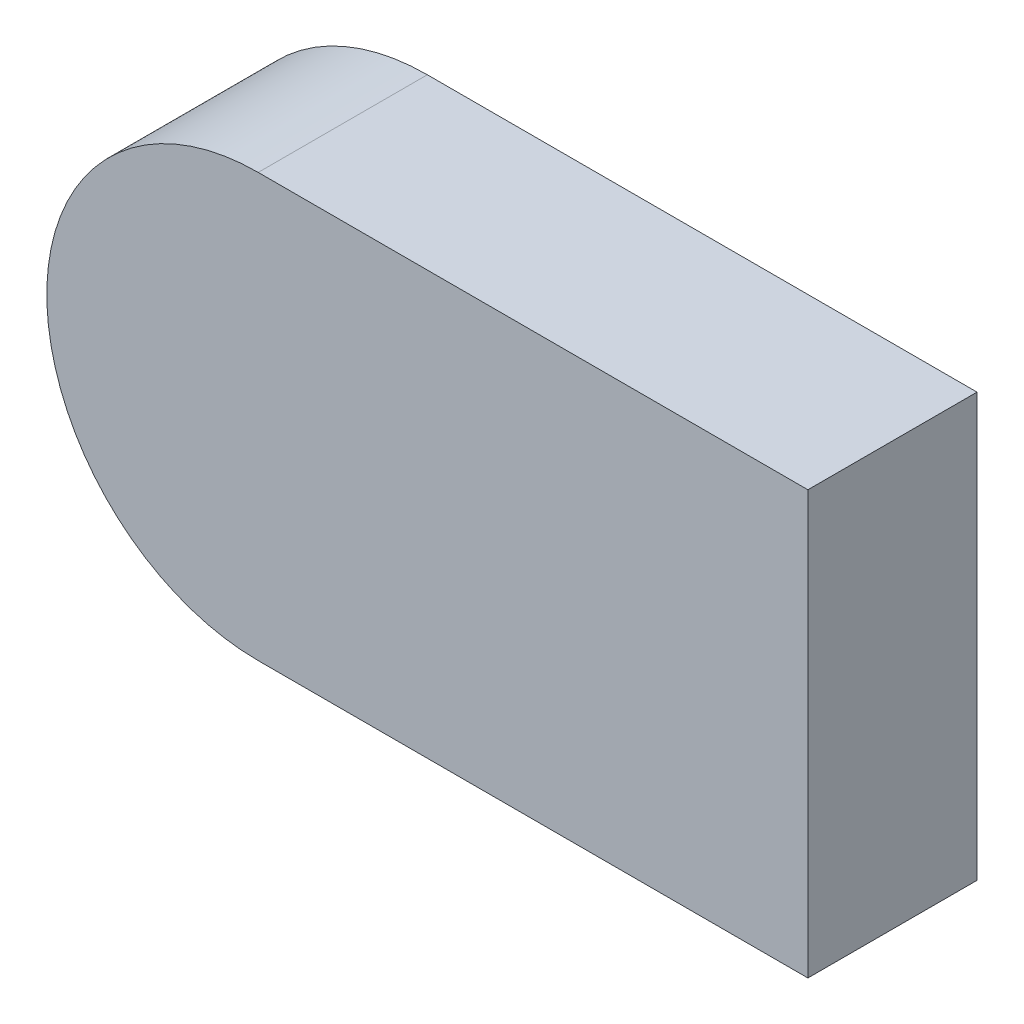
ISO-10303-21;
HEADER;
FILE_DESCRIPTION(('STEP AP214'),'2;1');
FILE_NAME('part.step','',(''),(''),'','','');
FILE_SCHEMA(('AUTOMOTIVE_DESIGN { 1 0 10303 214 1 1 1 1 }'));
ENDSEC;
DATA;
#1=APPLICATION_CONTEXT('core data for automotive mechanical design processes');
#2=APPLICATION_PROTOCOL_DEFINITION('international standard','automotive_design',2000,#1);
#3=PRODUCT_CONTEXT('',#1,'mechanical');
#4=PRODUCT('Part','Part','',(#3));
#5=PRODUCT_RELATED_PRODUCT_CATEGORY('part','',(#4));
#6=PRODUCT_DEFINITION_FORMATION('','',#4);
#7=PRODUCT_DEFINITION_CONTEXT('part definition',#1,'design');
#8=PRODUCT_DEFINITION('design','',#6,#7);
#9=PRODUCT_DEFINITION_SHAPE('','',#8);
#10=(LENGTH_UNIT() NAMED_UNIT(*) SI_UNIT(.MILLI.,.METRE.));
#11=(NAMED_UNIT(*) PLANE_ANGLE_UNIT() SI_UNIT($,.RADIAN.));
#12=(NAMED_UNIT(*) SI_UNIT($,.STERADIAN.) SOLID_ANGLE_UNIT());
#13=UNCERTAINTY_MEASURE_WITH_UNIT(LENGTH_MEASURE(1.E-05),#10,'distance_accuracy_value','');
#14=(GEOMETRIC_REPRESENTATION_CONTEXT(3) GLOBAL_UNCERTAINTY_ASSIGNED_CONTEXT((#13)) GLOBAL_UNIT_ASSIGNED_CONTEXT((#10,
#11,#12)) REPRESENTATION_CONTEXT('',''));
#15=CARTESIAN_POINT('',(0.,0.,0.));
#16=DIRECTION('',(0.,0.,1.));
#17=DIRECTION('',(1.,0.,0.));
#18=AXIS2_PLACEMENT_3D('',#15,#16,#17);
#19=CARTESIAN_POINT('',(2.05,-0.875,0.));
#20=DIRECTION('',(0.,-1.,0.));
#21=DIRECTION('',(-1.,0.,0.));
#22=AXIS2_PLACEMENT_3D('',#19,#20,#21);
#23=PLANE('',#22);
#24=DIRECTION('',(0.,0.,1.));
#25=VECTOR('',#24,1.);
#26=CARTESIAN_POINT('',(2.05,-0.875,0.));
#27=LINE('',#26,#25);
#28=CARTESIAN_POINT('',(2.05,-0.875,0.));
#29=VERTEX_POINT('',#28);
#30=CARTESIAN_POINT('',(2.05,-0.875,0.1));
#31=VERTEX_POINT('',#30);
#32=EDGE_CURVE('E11',#29,#31,#27,.T.);
#33=ORIENTED_EDGE('',*,*,#32,.T.);
#34=DIRECTION('',(-1.,0.,0.));
#35=VECTOR('',#34,1.);
#36=CARTESIAN_POINT('',(2.05,-0.875,0.1));
#37=LINE('',#36,#35);
#38=CARTESIAN_POINT('',(1.725,-0.875,0.1));
#39=VERTEX_POINT('',#38);
#40=EDGE_CURVE('E24',#31,#39,#37,.T.);
#41=ORIENTED_EDGE('',*,*,#40,.T.);
#42=DIRECTION('',(0.,0.,1.));
#43=VECTOR('',#42,1.);
#44=CARTESIAN_POINT('',(1.725,-0.875,0.));
#45=LINE('',#44,#43);
#46=CARTESIAN_POINT('',(1.725,-0.875,0.));
#47=VERTEX_POINT('',#46);
#48=EDGE_CURVE('E86',#47,#39,#45,.T.);
#49=ORIENTED_EDGE('',*,*,#48,.F.);
#50=DIRECTION('',(-1.,0.,0.));
#51=VECTOR('',#50,1.);
#52=CARTESIAN_POINT('',(2.05,-0.875,0.));
#53=LINE('',#52,#51);
#54=EDGE_CURVE('E83',#29,#47,#53,.T.);
#55=ORIENTED_EDGE('',*,*,#54,.F.);
#56=EDGE_LOOP('',(#33,#41,#49,#55));
#57=FACE_BOUND('',#56,.T.);
#58=ADVANCED_FACE('F17',(#57),#23,.T.);
#59=CARTESIAN_POINT('',(1.725,-0.75,0.));
#60=DIRECTION('',(0.,0.,-1.));
#61=DIRECTION('',(1.,0.,0.));
#62=AXIS2_PLACEMENT_3D('',#59,#60,#61);
#63=CYLINDRICAL_SURFACE('',#62,0.125);
#64=CARTESIAN_POINT('',(1.725,-0.75,0.));
#65=DIRECTION('',(0.,0.,1.));
#66=DIRECTION('',(1.,0.,0.));
#67=AXIS2_PLACEMENT_3D('',#64,#65,#66);
#68=CIRCLE('',#67,0.125);
#69=CARTESIAN_POINT('',(1.725,-0.625,0.));
#70=VERTEX_POINT('',#69);
#71=EDGE_CURVE('E80',#70,#47,#68,.T.);
#72=ORIENTED_EDGE('',*,*,#71,.T.);
#73=ORIENTED_EDGE('',*,*,#48,.T.);
#74=CARTESIAN_POINT('',(1.725,-0.75,0.1));
#75=DIRECTION('',(0.,0.,1.));
#76=DIRECTION('',(1.,0.,0.));
#77=AXIS2_PLACEMENT_3D('',#74,#75,#76);
#78=CIRCLE('',#77,0.125);
#79=CARTESIAN_POINT('',(1.725,-0.625,0.1));
#80=VERTEX_POINT('',#79);
#81=EDGE_CURVE('E78',#80,#39,#78,.T.);
#82=ORIENTED_EDGE('',*,*,#81,.F.);
#83=DIRECTION('',(0.,0.,1.));
#84=VECTOR('',#83,1.);
#85=CARTESIAN_POINT('',(1.725,-0.625,0.));
#86=LINE('',#85,#84);
#87=EDGE_CURVE('E67',#70,#80,#86,.T.);
#88=ORIENTED_EDGE('',*,*,#87,.F.);
#89=EDGE_LOOP('',(#72,#73,#82,#88));
#90=FACE_BOUND('',#89,.T.);
#91=ADVANCED_FACE('F89',(#90),#63,.T.);
#92=CARTESIAN_POINT('',(2.05,-0.625,0.));
#93=DIRECTION('',(0.,-1.,0.));
#94=DIRECTION('',(-1.,0.,0.));
#95=AXIS2_PLACEMENT_3D('',#92,#93,#94);
#96=PLANE('',#95);
#97=DIRECTION('',(-1.,0.,0.));
#98=VECTOR('',#97,1.);
#99=CARTESIAN_POINT('',(2.05,-0.625,0.));
#100=LINE('',#99,#98);
#101=CARTESIAN_POINT('',(2.05,-0.625,0.));
#102=VERTEX_POINT('',#101);
#103=EDGE_CURVE('E70',#102,#70,#100,.T.);
#104=ORIENTED_EDGE('',*,*,#103,.T.);
#105=ORIENTED_EDGE('',*,*,#87,.T.);
#106=DIRECTION('',(-1.,0.,0.));
#107=VECTOR('',#106,1.);
#108=CARTESIAN_POINT('',(2.05,-0.625,0.1));
#109=LINE('',#108,#107);
#110=CARTESIAN_POINT('',(2.05,-0.625,0.1));
#111=VERTEX_POINT('',#110);
#112=EDGE_CURVE('E61',#111,#80,#109,.T.);
#113=ORIENTED_EDGE('',*,*,#112,.F.);
#114=DIRECTION('',(0.,0.,1.));
#115=VECTOR('',#114,1.);
#116=CARTESIAN_POINT('',(2.05,-0.625,0.));
#117=LINE('',#116,#115);
#118=EDGE_CURVE('E51',#102,#111,#117,.T.);
#119=ORIENTED_EDGE('',*,*,#118,.F.);
#120=EDGE_LOOP('',(#104,#105,#113,#119));
#121=FACE_BOUND('',#120,.T.);
#122=ADVANCED_FACE('F65',(#121),#96,.F.);
#123=CARTESIAN_POINT('',(2.05,-0.875,0.));
#124=DIRECTION('',(-1.,0.,0.));
#125=DIRECTION('',(0.,1.,0.));
#126=AXIS2_PLACEMENT_3D('',#123,#124,#125);
#127=PLANE('',#126);
#128=DIRECTION('',(0.,1.,0.));
#129=VECTOR('',#128,1.);
#130=CARTESIAN_POINT('',(2.05,-0.875,0.));
#131=LINE('',#130,#129);
#132=EDGE_CURVE('E57',#29,#102,#131,.T.);
#133=ORIENTED_EDGE('',*,*,#132,.T.);
#134=ORIENTED_EDGE('',*,*,#118,.T.);
#135=DIRECTION('',(0.,1.,0.));
#136=VECTOR('',#135,1.);
#137=CARTESIAN_POINT('',(2.05,-0.875,0.1));
#138=LINE('',#137,#136);
#139=EDGE_CURVE('E55',#31,#111,#138,.T.);
#140=ORIENTED_EDGE('',*,*,#139,.F.);
#141=ORIENTED_EDGE('',*,*,#32,.F.);
#142=EDGE_LOOP('',(#133,#134,#140,#141));
#143=FACE_BOUND('',#142,.T.);
#144=ADVANCED_FACE('F53',(#143),#127,.F.);
#145=CARTESIAN_POINT('',(1.850342514613,-0.75,0.));
#146=DIRECTION('',(0.,0.,-1.));
#147=DIRECTION('',(-1.,0.,0.));
#148=AXIS2_PLACEMENT_3D('',#145,#146,#147);
#149=PLANE('',#148);
#150=ORIENTED_EDGE('',*,*,#54,.T.);
#151=ORIENTED_EDGE('',*,*,#71,.F.);
#152=ORIENTED_EDGE('',*,*,#103,.F.);
#153=ORIENTED_EDGE('',*,*,#132,.F.);
#154=EDGE_LOOP('',(#150,#151,#152,#153));
#155=FACE_BOUND('',#154,.T.);
#156=ADVANCED_FACE('F91',(#155),#149,.T.);
#157=CARTESIAN_POINT('',(1.850342514613,-0.75,0.1));
#158=DIRECTION('',(0.,0.,-1.));
#159=DIRECTION('',(-1.,0.,0.));
#160=AXIS2_PLACEMENT_3D('',#157,#158,#159);
#161=PLANE('',#160);
#162=ORIENTED_EDGE('',*,*,#139,.T.);
#163=ORIENTED_EDGE('',*,*,#112,.T.);
#164=ORIENTED_EDGE('',*,*,#81,.T.);
#165=ORIENTED_EDGE('',*,*,#40,.F.);
#166=EDGE_LOOP('',(#162,#163,#164,#165));
#167=FACE_BOUND('',#166,.T.);
#168=ADVANCED_FACE('F72',(#167),#161,.F.);
#169=CLOSED_SHELL('',(#58,#91,#122,#144,#156,#168));
#170=MANIFOLD_SOLID_BREP('B1',#169);
#171=ADVANCED_BREP_SHAPE_REPRESENTATION('',(#18,#170),#14);
#172=SHAPE_DEFINITION_REPRESENTATION(#9,#171);
ENDSEC;
END-ISO-10303-21;
